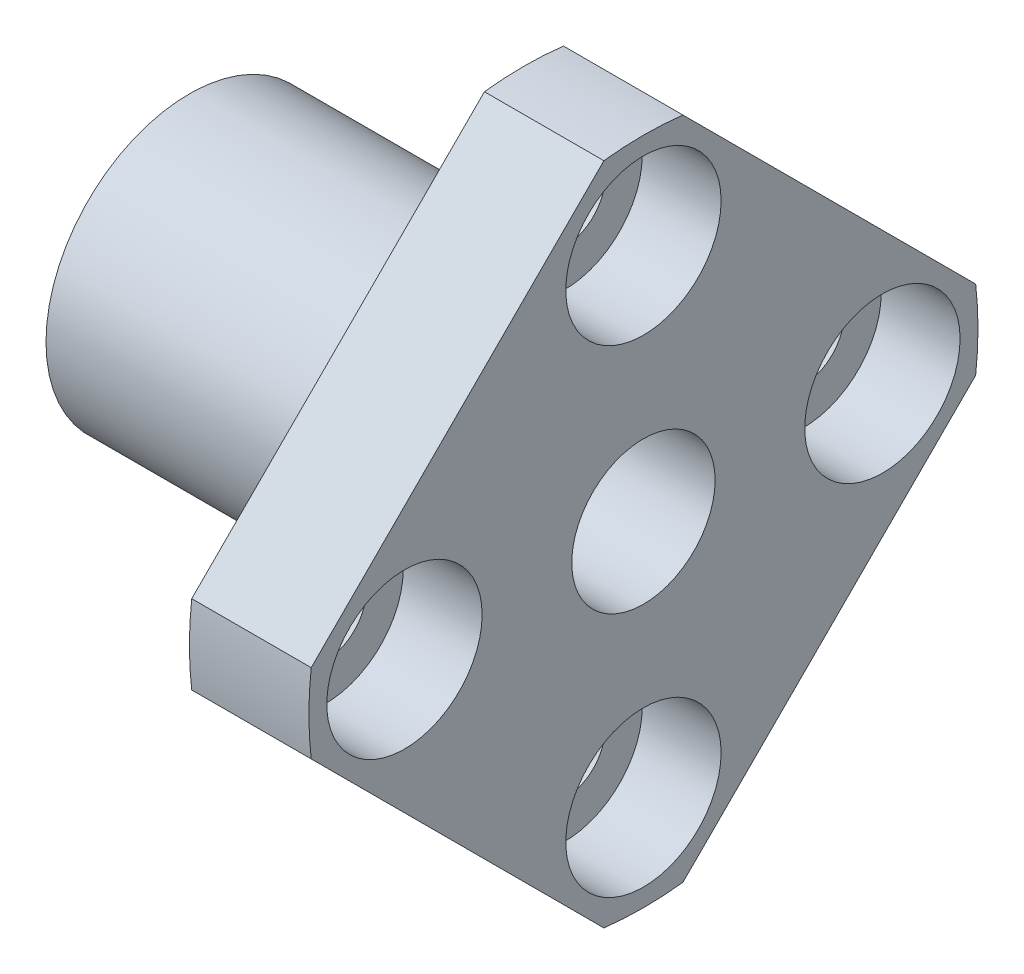
ISO-10303-21;
HEADER;
FILE_DESCRIPTION(('STEP AP214'),'2;1');
FILE_NAME('part.step','',(''),(''),'','','');
FILE_SCHEMA(('AUTOMOTIVE_DESIGN { 1 0 10303 214 1 1 1 1 }'));
ENDSEC;
DATA;
#1=APPLICATION_CONTEXT('core data for automotive mechanical design processes');
#2=APPLICATION_PROTOCOL_DEFINITION('international standard','automotive_design',2000,#1);
#3=PRODUCT_CONTEXT('',#1,'mechanical');
#4=PRODUCT('Part','Part','',(#3));
#5=PRODUCT_RELATED_PRODUCT_CATEGORY('part','',(#4));
#6=PRODUCT_DEFINITION_FORMATION('','',#4);
#7=PRODUCT_DEFINITION_CONTEXT('part definition',#1,'design');
#8=PRODUCT_DEFINITION('design','',#6,#7);
#9=PRODUCT_DEFINITION_SHAPE('','',#8);
#10=(LENGTH_UNIT() NAMED_UNIT(*) SI_UNIT(.MILLI.,.METRE.));
#11=(NAMED_UNIT(*) PLANE_ANGLE_UNIT() SI_UNIT($,.RADIAN.));
#12=(NAMED_UNIT(*) SI_UNIT($,.STERADIAN.) SOLID_ANGLE_UNIT());
#13=UNCERTAINTY_MEASURE_WITH_UNIT(LENGTH_MEASURE(1.E-05),#10,'distance_accuracy_value','');
#14=(GEOMETRIC_REPRESENTATION_CONTEXT(3) GLOBAL_UNCERTAINTY_ASSIGNED_CONTEXT((#13)) GLOBAL_UNIT_ASSIGNED_CONTEXT((#10,
#11,#12)) REPRESENTATION_CONTEXT('',''));
#15=CARTESIAN_POINT('',(0.,0.,0.));
#16=DIRECTION('',(0.,0.,1.));
#17=DIRECTION('',(1.,0.,0.));
#18=AXIS2_PLACEMENT_3D('',#15,#16,#17);
#19=CARTESIAN_POINT('',(19.,0.,0.));
#20=DIRECTION('',(-1.,0.,0.));
#21=DIRECTION('',(0.,0.,1.));
#22=AXIS2_PLACEMENT_3D('',#19,#20,#21);
#23=CYLINDRICAL_SURFACE('',#22,14.);
#24=CARTESIAN_POINT('',(14.,0.,0.));
#25=DIRECTION('',(-1.,0.,0.));
#26=DIRECTION('',(0.,0.,1.));
#27=AXIS2_PLACEMENT_3D('',#24,#25,#26);
#28=CIRCLE('',#27,14.);
#29=CARTESIAN_POINT('',(14.,-1.65445023609401,13.90189895001));
#30=VERTEX_POINT('',#29);
#31=CARTESIAN_POINT('',(14.,1.65445023609401,13.90189895001));
#32=VERTEX_POINT('',#31);
#33=EDGE_CURVE('E132',#30,#32,#28,.T.);
#34=ORIENTED_EDGE('',*,*,#33,.F.);
#35=DIRECTION('',(-1.,0.,0.));
#36=VECTOR('',#35,1.);
#37=CARTESIAN_POINT('',(19.,-1.65445023609401,13.90189895001));
#38=LINE('',#37,#36);
#39=CARTESIAN_POINT('',(19.,-1.65445023609401,13.90189895001));
#40=VERTEX_POINT('',#39);
#41=EDGE_CURVE('E41',#40,#30,#38,.T.);
#42=ORIENTED_EDGE('',*,*,#41,.F.);
#43=CARTESIAN_POINT('',(19.,0.,0.));
#44=DIRECTION('',(-1.,0.,0.));
#45=DIRECTION('',(0.,0.,1.));
#46=AXIS2_PLACEMENT_3D('',#43,#44,#45);
#47=CIRCLE('',#46,14.);
#48=CARTESIAN_POINT('',(19.,1.65445023609401,13.90189895001));
#49=VERTEX_POINT('',#48);
#50=EDGE_CURVE('E154',#40,#49,#47,.T.);
#51=ORIENTED_EDGE('',*,*,#50,.T.);
#52=DIRECTION('',(-1.,0.,0.));
#53=VECTOR('',#52,1.);
#54=CARTESIAN_POINT('',(19.,1.65445023609401,13.90189895001));
#55=LINE('',#54,#53);
#56=EDGE_CURVE('E90',#49,#32,#55,.T.);
#57=ORIENTED_EDGE('',*,*,#56,.T.);
#58=EDGE_LOOP('',(#34,#42,#51,#57));
#59=FACE_BOUND('',#58,.T.);
#60=ADVANCED_FACE('F32',(#59),#23,.T.);
#61=CARTESIAN_POINT('',(19.,-13.90189895001,1.65445023609401));
#62=DIRECTION('',(0.,-0.707106781186548,0.707106781186547));
#63=DIRECTION('',(0.,-0.707106781186547,-0.707106781186548));
#64=AXIS2_PLACEMENT_3D('',#61,#62,#63);
#65=PLANE('',#64);
#66=DIRECTION('',(0.,0.707106781186547,0.707106781186548));
#67=VECTOR('',#66,1.);
#68=CARTESIAN_POINT('',(14.,-13.90189895001,1.65445023609401));
#69=LINE('',#68,#67);
#70=CARTESIAN_POINT('',(14.,-13.90189895001,1.65445023609402));
#71=VERTEX_POINT('',#70);
#72=EDGE_CURVE('E151',#71,#30,#69,.T.);
#73=ORIENTED_EDGE('',*,*,#72,.F.);
#74=DIRECTION('',(-1.,0.,0.));
#75=VECTOR('',#74,1.);
#76=CARTESIAN_POINT('',(19.,-13.90189895001,1.65445023609402));
#77=LINE('',#76,#75);
#78=CARTESIAN_POINT('',(19.,-13.90189895001,1.65445023609402));
#79=VERTEX_POINT('',#78);
#80=EDGE_CURVE('E78',#79,#71,#77,.T.);
#81=ORIENTED_EDGE('',*,*,#80,.F.);
#82=DIRECTION('',(0.,0.707106781186547,0.707106781186548));
#83=VECTOR('',#82,1.);
#84=CARTESIAN_POINT('',(19.,-13.90189895001,1.65445023609401));
#85=LINE('',#84,#83);
#86=EDGE_CURVE('E122',#79,#40,#85,.T.);
#87=ORIENTED_EDGE('',*,*,#86,.T.);
#88=ORIENTED_EDGE('',*,*,#41,.T.);
#89=EDGE_LOOP('',(#73,#81,#87,#88));
#90=FACE_BOUND('',#89,.T.);
#91=ADVANCED_FACE('F229',(#90),#65,.T.);
#92=CARTESIAN_POINT('',(19.,0.,0.));
#93=DIRECTION('',(-1.,0.,0.));
#94=DIRECTION('',(0.,0.,1.));
#95=AXIS2_PLACEMENT_3D('',#92,#93,#94);
#96=CYLINDRICAL_SURFACE('',#95,14.);
#97=CARTESIAN_POINT('',(14.,0.,0.));
#98=DIRECTION('',(-1.,0.,0.));
#99=DIRECTION('',(0.,0.,1.));
#100=AXIS2_PLACEMENT_3D('',#97,#98,#99);
#101=CIRCLE('',#100,14.);
#102=CARTESIAN_POINT('',(14.,-13.90189895001,-1.65445023609401));
#103=VERTEX_POINT('',#102);
#104=EDGE_CURVE('E109',#103,#71,#101,.T.);
#105=ORIENTED_EDGE('',*,*,#104,.F.);
#106=DIRECTION('',(-1.,0.,0.));
#107=VECTOR('',#106,1.);
#108=CARTESIAN_POINT('',(19.,-13.90189895001,-1.65445023609401));
#109=LINE('',#108,#107);
#110=CARTESIAN_POINT('',(19.,-13.90189895001,-1.65445023609401));
#111=VERTEX_POINT('',#110);
#112=EDGE_CURVE('E104',#111,#103,#109,.T.);
#113=ORIENTED_EDGE('',*,*,#112,.F.);
#114=CARTESIAN_POINT('',(19.,0.,0.));
#115=DIRECTION('',(-1.,0.,0.));
#116=DIRECTION('',(0.,0.,1.));
#117=AXIS2_PLACEMENT_3D('',#114,#115,#116);
#118=CIRCLE('',#117,14.);
#119=EDGE_CURVE('E107',#111,#79,#118,.T.);
#120=ORIENTED_EDGE('',*,*,#119,.T.);
#121=ORIENTED_EDGE('',*,*,#80,.T.);
#122=EDGE_LOOP('',(#105,#113,#120,#121));
#123=FACE_BOUND('',#122,.T.);
#124=ADVANCED_FACE('F106',(#123),#96,.T.);
#125=CARTESIAN_POINT('',(19.,-1.65445023609401,-13.90189895001));
#126=DIRECTION('',(0.,-0.707106781186548,-0.707106781186547));
#127=DIRECTION('',(0.,0.707106781186547,-0.707106781186548));
#128=AXIS2_PLACEMENT_3D('',#125,#126,#127);
#129=PLANE('',#128);
#130=DIRECTION('',(0.,-0.707106781186547,0.707106781186548));
#131=VECTOR('',#130,1.);
#132=CARTESIAN_POINT('',(14.,-1.65445023609401,-13.90189895001));
#133=LINE('',#132,#131);
#134=CARTESIAN_POINT('',(14.,-1.65445023609401,-13.90189895001));
#135=VERTEX_POINT('',#134);
#136=EDGE_CURVE('E148',#135,#103,#133,.T.);
#137=ORIENTED_EDGE('',*,*,#136,.F.);
#138=DIRECTION('',(-1.,0.,0.));
#139=VECTOR('',#138,1.);
#140=CARTESIAN_POINT('',(19.,-1.65445023609401,-13.90189895001));
#141=LINE('',#140,#139);
#142=CARTESIAN_POINT('',(19.,-1.65445023609401,-13.90189895001));
#143=VERTEX_POINT('',#142);
#144=EDGE_CURVE('E114',#143,#135,#141,.T.);
#145=ORIENTED_EDGE('',*,*,#144,.F.);
#146=DIRECTION('',(0.,-0.707106781186547,0.707106781186548));
#147=VECTOR('',#146,1.);
#148=CARTESIAN_POINT('',(19.,-1.65445023609401,-13.90189895001));
#149=LINE('',#148,#147);
#150=EDGE_CURVE('E120',#143,#111,#149,.T.);
#151=ORIENTED_EDGE('',*,*,#150,.T.);
#152=ORIENTED_EDGE('',*,*,#112,.T.);
#153=EDGE_LOOP('',(#137,#145,#151,#152));
#154=FACE_BOUND('',#153,.T.);
#155=ADVANCED_FACE('F124',(#154),#129,.T.);
#156=CARTESIAN_POINT('',(19.,0.,0.));
#157=DIRECTION('',(-1.,0.,0.));
#158=DIRECTION('',(0.,0.,1.));
#159=AXIS2_PLACEMENT_3D('',#156,#157,#158);
#160=CYLINDRICAL_SURFACE('',#159,14.);
#161=CARTESIAN_POINT('',(14.,0.,0.));
#162=DIRECTION('',(-1.,0.,0.));
#163=DIRECTION('',(0.,0.,1.));
#164=AXIS2_PLACEMENT_3D('',#161,#162,#163);
#165=CIRCLE('',#164,14.);
#166=CARTESIAN_POINT('',(14.,1.65445023609401,-13.90189895001));
#167=VERTEX_POINT('',#166);
#168=EDGE_CURVE('E145',#167,#135,#165,.T.);
#169=ORIENTED_EDGE('',*,*,#168,.F.);
#170=DIRECTION('',(-1.,0.,0.));
#171=VECTOR('',#170,1.);
#172=CARTESIAN_POINT('',(19.,1.65445023609401,-13.90189895001));
#173=LINE('',#172,#171);
#174=CARTESIAN_POINT('',(19.,1.65445023609401,-13.90189895001));
#175=VERTEX_POINT('',#174);
#176=EDGE_CURVE('E158',#175,#167,#173,.T.);
#177=ORIENTED_EDGE('',*,*,#176,.F.);
#178=CARTESIAN_POINT('',(19.,0.,0.));
#179=DIRECTION('',(-1.,0.,0.));
#180=DIRECTION('',(0.,0.,1.));
#181=AXIS2_PLACEMENT_3D('',#178,#179,#180);
#182=CIRCLE('',#181,14.);
#183=EDGE_CURVE('E125',#175,#143,#182,.T.);
#184=ORIENTED_EDGE('',*,*,#183,.T.);
#185=ORIENTED_EDGE('',*,*,#144,.T.);
#186=EDGE_LOOP('',(#169,#177,#184,#185));
#187=FACE_BOUND('',#186,.T.);
#188=ADVANCED_FACE('F242',(#187),#160,.T.);
#189=CARTESIAN_POINT('',(19.,13.90189895001,-1.65445023609402));
#190=DIRECTION('',(0.,0.707106781186547,-0.707106781186548));
#191=DIRECTION('',(0.,0.707106781186548,0.707106781186547));
#192=AXIS2_PLACEMENT_3D('',#189,#190,#191);
#193=PLANE('',#192);
#194=DIRECTION('',(0.,-0.707106781186548,-0.707106781186548));
#195=VECTOR('',#194,1.);
#196=CARTESIAN_POINT('',(14.,13.90189895001,-1.65445023609402));
#197=LINE('',#196,#195);
#198=CARTESIAN_POINT('',(14.,13.90189895001,-1.65445023609401));
#199=VERTEX_POINT('',#198);
#200=EDGE_CURVE('E142',#199,#167,#197,.T.);
#201=ORIENTED_EDGE('',*,*,#200,.F.);
#202=DIRECTION('',(-1.,0.,0.));
#203=VECTOR('',#202,1.);
#204=CARTESIAN_POINT('',(19.,13.90189895001,-1.65445023609401));
#205=LINE('',#204,#203);
#206=CARTESIAN_POINT('',(19.,13.90189895001,-1.65445023609401));
#207=VERTEX_POINT('',#206);
#208=EDGE_CURVE('E160',#207,#199,#205,.T.);
#209=ORIENTED_EDGE('',*,*,#208,.F.);
#210=DIRECTION('',(0.,-0.707106781186548,-0.707106781186548));
#211=VECTOR('',#210,1.);
#212=CARTESIAN_POINT('',(19.,13.90189895001,-1.65445023609402));
#213=LINE('',#212,#211);
#214=EDGE_CURVE('E127',#207,#175,#213,.T.);
#215=ORIENTED_EDGE('',*,*,#214,.T.);
#216=ORIENTED_EDGE('',*,*,#176,.T.);
#217=EDGE_LOOP('',(#201,#209,#215,#216));
#218=FACE_BOUND('',#217,.T.);
#219=ADVANCED_FACE('F220',(#218),#193,.T.);
#220=CARTESIAN_POINT('',(19.,0.,0.));
#221=DIRECTION('',(-1.,0.,0.));
#222=DIRECTION('',(0.,0.,1.));
#223=AXIS2_PLACEMENT_3D('',#220,#221,#222);
#224=CYLINDRICAL_SURFACE('',#223,14.);
#225=CARTESIAN_POINT('',(14.,0.,0.));
#226=DIRECTION('',(-1.,0.,0.));
#227=DIRECTION('',(0.,0.,1.));
#228=AXIS2_PLACEMENT_3D('',#225,#226,#227);
#229=CIRCLE('',#228,14.);
#230=CARTESIAN_POINT('',(14.,13.90189895001,1.65445023609402));
#231=VERTEX_POINT('',#230);
#232=EDGE_CURVE('E139',#231,#199,#229,.T.);
#233=ORIENTED_EDGE('',*,*,#232,.F.);
#234=DIRECTION('',(-1.,0.,0.));
#235=VECTOR('',#234,1.);
#236=CARTESIAN_POINT('',(19.,13.90189895001,1.65445023609402));
#237=LINE('',#236,#235);
#238=CARTESIAN_POINT('',(19.,13.90189895001,1.65445023609402));
#239=VERTEX_POINT('',#238);
#240=EDGE_CURVE('E162',#239,#231,#237,.T.);
#241=ORIENTED_EDGE('',*,*,#240,.F.);
#242=CARTESIAN_POINT('',(19.,0.,0.));
#243=DIRECTION('',(-1.,0.,0.));
#244=DIRECTION('',(0.,0.,1.));
#245=AXIS2_PLACEMENT_3D('',#242,#243,#244);
#246=CIRCLE('',#245,14.);
#247=EDGE_CURVE('E214',#239,#207,#246,.T.);
#248=ORIENTED_EDGE('',*,*,#247,.T.);
#249=ORIENTED_EDGE('',*,*,#208,.T.);
#250=EDGE_LOOP('',(#233,#241,#248,#249));
#251=FACE_BOUND('',#250,.T.);
#252=ADVANCED_FACE('F225',(#251),#224,.T.);
#253=CARTESIAN_POINT('',(19.,1.65445023609401,13.90189895001));
#254=DIRECTION('',(0.,0.707106781186547,0.707106781186548));
#255=DIRECTION('',(0.,-0.707106781186548,0.707106781186547));
#256=AXIS2_PLACEMENT_3D('',#253,#254,#255);
#257=PLANE('',#256);
#258=DIRECTION('',(0.,0.707106781186548,-0.707106781186547));
#259=VECTOR('',#258,1.);
#260=CARTESIAN_POINT('',(14.,1.65445023609401,13.90189895001));
#261=LINE('',#260,#259);
#262=EDGE_CURVE('E135',#32,#231,#261,.T.);
#263=ORIENTED_EDGE('',*,*,#262,.F.);
#264=ORIENTED_EDGE('',*,*,#56,.F.);
#265=DIRECTION('',(0.,0.707106781186548,-0.707106781186547));
#266=VECTOR('',#265,1.);
#267=CARTESIAN_POINT('',(19.,1.65445023609401,13.90189895001));
#268=LINE('',#267,#266);
#269=EDGE_CURVE('E212',#49,#239,#268,.T.);
#270=ORIENTED_EDGE('',*,*,#269,.T.);
#271=ORIENTED_EDGE('',*,*,#240,.T.);
#272=EDGE_LOOP('',(#263,#264,#270,#271));
#273=FACE_BOUND('',#272,.T.);
#274=ADVANCED_FACE('F226',(#273),#257,.T.);
#275=CARTESIAN_POINT('',(19.,0.,0.));
#276=DIRECTION('',(-1.,0.,0.));
#277=DIRECTION('',(0.,0.,1.));
#278=AXIS2_PLACEMENT_3D('',#275,#276,#277);
#279=PLANE('',#278);
#280=CARTESIAN_POINT('',(19.,-10.,0.));
#281=DIRECTION('',(1.,0.,0.));
#282=DIRECTION('',(0.,0.,-1.));
#283=AXIS2_PLACEMENT_3D('',#280,#281,#282);
#284=CIRCLE('',#283,3.25);
#285=CARTESIAN_POINT('',(19.,-10.,-3.25));
#286=VERTEX_POINT('',#285);
#287=EDGE_CURVE('E326',#286,#286,#284,.T.);
#288=ORIENTED_EDGE('',*,*,#287,.F.);
#289=EDGE_LOOP('',(#288));
#290=FACE_BOUND('',#289,.T.);
#291=CARTESIAN_POINT('',(19.,0.,-10.));
#292=DIRECTION('',(1.,0.,0.));
#293=DIRECTION('',(0.,0.,-1.));
#294=AXIS2_PLACEMENT_3D('',#291,#292,#293);
#295=CIRCLE('',#294,3.25);
#296=CARTESIAN_POINT('',(19.,0.,-13.25));
#297=VERTEX_POINT('',#296);
#298=EDGE_CURVE('E189',#297,#297,#295,.T.);
#299=ORIENTED_EDGE('',*,*,#298,.F.);
#300=EDGE_LOOP('',(#299));
#301=FACE_BOUND('',#300,.T.);
#302=CARTESIAN_POINT('',(19.,0.,10.));
#303=DIRECTION('',(1.,0.,0.));
#304=DIRECTION('',(0.,0.,-1.));
#305=AXIS2_PLACEMENT_3D('',#302,#303,#304);
#306=CIRCLE('',#305,3.25);
#307=CARTESIAN_POINT('',(19.,0.,6.75));
#308=VERTEX_POINT('',#307);
#309=EDGE_CURVE('E176',#308,#308,#306,.T.);
#310=ORIENTED_EDGE('',*,*,#309,.F.);
#311=EDGE_LOOP('',(#310));
#312=FACE_BOUND('',#311,.T.);
#313=CARTESIAN_POINT('',(19.,10.,0.));
#314=DIRECTION('',(1.,0.,0.));
#315=DIRECTION('',(0.,0.,-1.));
#316=AXIS2_PLACEMENT_3D('',#313,#314,#315);
#317=CIRCLE('',#316,3.25);
#318=CARTESIAN_POINT('',(19.,10.,-3.25));
#319=VERTEX_POINT('',#318);
#320=EDGE_CURVE('E172',#319,#319,#317,.T.);
#321=ORIENTED_EDGE('',*,*,#320,.F.);
#322=EDGE_LOOP('',(#321));
#323=FACE_BOUND('',#322,.T.);
#324=CARTESIAN_POINT('',(19.,0.,0.));
#325=DIRECTION('',(1.,0.,0.));
#326=DIRECTION('',(0.,0.,-1.));
#327=AXIS2_PLACEMENT_3D('',#324,#325,#326);
#328=CIRCLE('',#327,2.99999999999999);
#329=CARTESIAN_POINT('',(19.,0.,-2.99999999999999));
#330=VERTEX_POINT('',#329);
#331=EDGE_CURVE('E168',#330,#330,#328,.T.);
#332=ORIENTED_EDGE('',*,*,#331,.F.);
#333=EDGE_LOOP('',(#332));
#334=FACE_BOUND('',#333,.T.);
#335=ORIENTED_EDGE('',*,*,#50,.F.);
#336=ORIENTED_EDGE('',*,*,#86,.F.);
#337=ORIENTED_EDGE('',*,*,#119,.F.);
#338=ORIENTED_EDGE('',*,*,#150,.F.);
#339=ORIENTED_EDGE('',*,*,#183,.F.);
#340=ORIENTED_EDGE('',*,*,#214,.F.);
#341=ORIENTED_EDGE('',*,*,#247,.F.);
#342=ORIENTED_EDGE('',*,*,#269,.F.);
#343=EDGE_LOOP('',(#335,#336,#337,#338,#339,#340,#341,#342));
#344=FACE_BOUND('',#343,.T.);
#345=ADVANCED_FACE('F118',(#290,#301,#312,#323,#334,#344),#279,.F.);
#346=CARTESIAN_POINT('',(14.,0.,0.));
#347=DIRECTION('',(-1.,0.,0.));
#348=DIRECTION('',(0.,0.,1.));
#349=AXIS2_PLACEMENT_3D('',#346,#347,#348);
#350=PLANE('',#349);
#351=CARTESIAN_POINT('',(14.,-10.,0.));
#352=DIRECTION('',(-1.,0.,0.));
#353=DIRECTION('',(0.,0.,1.));
#354=AXIS2_PLACEMENT_3D('',#351,#352,#353);
#355=CIRCLE('',#354,1.70000000000001);
#356=CARTESIAN_POINT('',(14.,-10.,1.70000000000001));
#357=VERTEX_POINT('',#356);
#358=EDGE_CURVE('E35',#357,#357,#355,.T.);
#359=ORIENTED_EDGE('',*,*,#358,.F.);
#360=EDGE_LOOP('',(#359));
#361=FACE_BOUND('',#360,.T.);
#362=CARTESIAN_POINT('',(14.,0.,-10.));
#363=DIRECTION('',(-1.,0.,0.));
#364=DIRECTION('',(0.,0.,1.));
#365=AXIS2_PLACEMENT_3D('',#362,#363,#364);
#366=CIRCLE('',#365,1.70000000000001);
#367=CARTESIAN_POINT('',(14.,0.,-8.29999999999999));
#368=VERTEX_POINT('',#367);
#369=EDGE_CURVE('E174',#368,#368,#366,.T.);
#370=ORIENTED_EDGE('',*,*,#369,.F.);
#371=EDGE_LOOP('',(#370));
#372=FACE_BOUND('',#371,.T.);
#373=CARTESIAN_POINT('',(14.,0.,10.));
#374=DIRECTION('',(-1.,0.,0.));
#375=DIRECTION('',(0.,0.,1.));
#376=AXIS2_PLACEMENT_3D('',#373,#374,#375);
#377=CIRCLE('',#376,1.70000000000001);
#378=CARTESIAN_POINT('',(14.,0.,11.7));
#379=VERTEX_POINT('',#378);
#380=EDGE_CURVE('E170',#379,#379,#377,.T.);
#381=ORIENTED_EDGE('',*,*,#380,.F.);
#382=EDGE_LOOP('',(#381));
#383=FACE_BOUND('',#382,.T.);
#384=CARTESIAN_POINT('',(14.,10.,0.));
#385=DIRECTION('',(-1.,0.,0.));
#386=DIRECTION('',(0.,0.,1.));
#387=AXIS2_PLACEMENT_3D('',#384,#385,#386);
#388=CIRCLE('',#387,1.70000000000001);
#389=CARTESIAN_POINT('',(14.,10.,1.70000000000001));
#390=VERTEX_POINT('',#389);
#391=EDGE_CURVE('E165',#390,#390,#388,.T.);
#392=ORIENTED_EDGE('',*,*,#391,.F.);
#393=EDGE_LOOP('',(#392));
#394=FACE_BOUND('',#393,.T.);
#395=CARTESIAN_POINT('',(14.,0.,0.));
#396=DIRECTION('',(-1.,0.,0.));
#397=DIRECTION('',(0.,0.,1.));
#398=AXIS2_PLACEMENT_3D('',#395,#396,#397);
#399=CIRCLE('',#398,6.);
#400=CARTESIAN_POINT('',(14.,0.,6.));
#401=VERTEX_POINT('',#400);
#402=EDGE_CURVE('E11',#401,#401,#399,.T.);
#403=ORIENTED_EDGE('',*,*,#402,.F.);
#404=EDGE_LOOP('',(#403));
#405=FACE_BOUND('',#404,.T.);
#406=ORIENTED_EDGE('',*,*,#33,.T.);
#407=ORIENTED_EDGE('',*,*,#262,.T.);
#408=ORIENTED_EDGE('',*,*,#232,.T.);
#409=ORIENTED_EDGE('',*,*,#200,.T.);
#410=ORIENTED_EDGE('',*,*,#168,.T.);
#411=ORIENTED_EDGE('',*,*,#136,.T.);
#412=ORIENTED_EDGE('',*,*,#104,.T.);
#413=ORIENTED_EDGE('',*,*,#72,.T.);
#414=EDGE_LOOP('',(#406,#407,#408,#409,#410,#411,#412,#413));
#415=FACE_BOUND('',#414,.T.);
#416=ADVANCED_FACE('F228',(#361,#372,#383,#394,#405,#415),#350,.T.);
#417=CARTESIAN_POINT('',(14.,0.,0.));
#418=DIRECTION('',(-1.,0.,0.));
#419=DIRECTION('',(0.,0.,1.));
#420=AXIS2_PLACEMENT_3D('',#417,#418,#419);
#421=CYLINDRICAL_SURFACE('',#420,6.);
#422=ORIENTED_EDGE('',*,*,#402,.T.);
#423=EDGE_LOOP('',(#422));
#424=FACE_BOUND('',#423,.T.);
#425=CARTESIAN_POINT('',(0.,0.,0.));
#426=DIRECTION('',(-1.,0.,0.));
#427=DIRECTION('',(0.,0.,1.));
#428=AXIS2_PLACEMENT_3D('',#425,#426,#427);
#429=CIRCLE('',#428,6.);
#430=CARTESIAN_POINT('',(0.,0.,6.));
#431=VERTEX_POINT('',#430);
#432=EDGE_CURVE('E136',#431,#431,#429,.T.);
#433=ORIENTED_EDGE('',*,*,#432,.F.);
#434=EDGE_LOOP('',(#433));
#435=FACE_BOUND('',#434,.T.);
#436=ADVANCED_FACE('F257',(#424,#435),#421,.T.);
#437=CARTESIAN_POINT('',(0.,0.,0.));
#438=DIRECTION('',(-1.,0.,0.));
#439=DIRECTION('',(0.,0.,1.));
#440=AXIS2_PLACEMENT_3D('',#437,#438,#439);
#441=PLANE('',#440);
#442=CARTESIAN_POINT('',(0.,0.,0.));
#443=DIRECTION('',(1.,0.,0.));
#444=DIRECTION('',(0.,0.,-1.));
#445=AXIS2_PLACEMENT_3D('',#442,#443,#444);
#446=CIRCLE('',#445,2.99999999999999);
#447=CARTESIAN_POINT('',(0.,0.,-2.99999999999999));
#448=VERTEX_POINT('',#447);
#449=EDGE_CURVE('E206',#448,#448,#446,.T.);
#450=ORIENTED_EDGE('',*,*,#449,.T.);
#451=EDGE_LOOP('',(#450));
#452=FACE_BOUND('',#451,.T.);
#453=ORIENTED_EDGE('',*,*,#432,.T.);
#454=EDGE_LOOP('',(#453));
#455=FACE_BOUND('',#454,.T.);
#456=ADVANCED_FACE('F264',(#452,#455),#441,.T.);
#457=CARTESIAN_POINT('',(19.,0.,0.));
#458=DIRECTION('',(1.,0.,0.));
#459=DIRECTION('',(0.,0.,-1.));
#460=AXIS2_PLACEMENT_3D('',#457,#458,#459);
#461=CYLINDRICAL_SURFACE('',#460,2.99999999999999);
#462=ORIENTED_EDGE('',*,*,#449,.F.);
#463=EDGE_LOOP('',(#462));
#464=FACE_BOUND('',#463,.T.);
#465=ORIENTED_EDGE('',*,*,#331,.T.);
#466=EDGE_LOOP('',(#465));
#467=FACE_BOUND('',#466,.T.);
#468=ADVANCED_FACE('F268',(#464,#467),#461,.F.);
#469=CARTESIAN_POINT('',(19.,10.,0.));
#470=DIRECTION('',(1.,0.,0.));
#471=DIRECTION('',(0.,0.,-1.));
#472=AXIS2_PLACEMENT_3D('',#469,#470,#471);
#473=CYLINDRICAL_SURFACE('',#472,1.70000000000001);
#474=ORIENTED_EDGE('',*,*,#391,.T.);
#475=EDGE_LOOP('',(#474));
#476=FACE_BOUND('',#475,.T.);
#477=CARTESIAN_POINT('',(15.7,10.,0.));
#478=DIRECTION('',(1.,0.,0.));
#479=DIRECTION('',(0.,0.,-1.));
#480=AXIS2_PLACEMENT_3D('',#477,#478,#479);
#481=CIRCLE('',#480,1.70000000000001);
#482=CARTESIAN_POINT('',(15.7,10.,-1.70000000000001));
#483=VERTEX_POINT('',#482);
#484=EDGE_CURVE('E169',#483,#483,#481,.T.);
#485=ORIENTED_EDGE('',*,*,#484,.T.);
#486=EDGE_LOOP('',(#485));
#487=FACE_BOUND('',#486,.T.);
#488=ADVANCED_FACE('F272',(#476,#487),#473,.F.);
#489=CARTESIAN_POINT('',(15.7,11.7,0.));
#490=DIRECTION('',(-1.,0.,0.));
#491=DIRECTION('',(0.,0.,1.));
#492=AXIS2_PLACEMENT_3D('',#489,#490,#491);
#493=PLANE('',#492);
#494=ORIENTED_EDGE('',*,*,#484,.F.);
#495=EDGE_LOOP('',(#494));
#496=FACE_BOUND('',#495,.T.);
#497=CARTESIAN_POINT('',(15.7,10.,0.));
#498=DIRECTION('',(1.,0.,0.));
#499=DIRECTION('',(0.,0.,-1.));
#500=AXIS2_PLACEMENT_3D('',#497,#498,#499);
#501=CIRCLE('',#500,3.25);
#502=CARTESIAN_POINT('',(15.7,10.,-3.25));
#503=VERTEX_POINT('',#502);
#504=EDGE_CURVE('E199',#503,#503,#501,.T.);
#505=ORIENTED_EDGE('',*,*,#504,.T.);
#506=EDGE_LOOP('',(#505));
#507=FACE_BOUND('',#506,.T.);
#508=ADVANCED_FACE('F276',(#496,#507),#493,.F.);
#509=CARTESIAN_POINT('',(19.,10.,0.));
#510=DIRECTION('',(1.,0.,0.));
#511=DIRECTION('',(0.,0.,-1.));
#512=AXIS2_PLACEMENT_3D('',#509,#510,#511);
#513=CYLINDRICAL_SURFACE('',#512,3.25);
#514=ORIENTED_EDGE('',*,*,#504,.F.);
#515=EDGE_LOOP('',(#514));
#516=FACE_BOUND('',#515,.T.);
#517=ORIENTED_EDGE('',*,*,#320,.T.);
#518=EDGE_LOOP('',(#517));
#519=FACE_BOUND('',#518,.T.);
#520=ADVANCED_FACE('F280',(#516,#519),#513,.F.);
#521=CARTESIAN_POINT('',(19.,0.,10.));
#522=DIRECTION('',(1.,0.,0.));
#523=DIRECTION('',(0.,0.,-1.));
#524=AXIS2_PLACEMENT_3D('',#521,#522,#523);
#525=CYLINDRICAL_SURFACE('',#524,1.70000000000001);
#526=ORIENTED_EDGE('',*,*,#380,.T.);
#527=EDGE_LOOP('',(#526));
#528=FACE_BOUND('',#527,.T.);
#529=CARTESIAN_POINT('',(15.7,0.,10.));
#530=DIRECTION('',(1.,0.,0.));
#531=DIRECTION('',(0.,0.,-1.));
#532=AXIS2_PLACEMENT_3D('',#529,#530,#531);
#533=CIRCLE('',#532,1.70000000000001);
#534=CARTESIAN_POINT('',(15.7,0.,8.29999999999999));
#535=VERTEX_POINT('',#534);
#536=EDGE_CURVE('E173',#535,#535,#533,.T.);
#537=ORIENTED_EDGE('',*,*,#536,.T.);
#538=EDGE_LOOP('',(#537));
#539=FACE_BOUND('',#538,.T.);
#540=ADVANCED_FACE('F284',(#528,#539),#525,.F.);
#541=CARTESIAN_POINT('',(15.7,1.70000000000001,10.));
#542=DIRECTION('',(-1.,0.,0.));
#543=DIRECTION('',(0.,0.,1.));
#544=AXIS2_PLACEMENT_3D('',#541,#542,#543);
#545=PLANE('',#544);
#546=ORIENTED_EDGE('',*,*,#536,.F.);
#547=EDGE_LOOP('',(#546));
#548=FACE_BOUND('',#547,.T.);
#549=CARTESIAN_POINT('',(15.7,0.,10.));
#550=DIRECTION('',(1.,0.,0.));
#551=DIRECTION('',(0.,0.,-1.));
#552=AXIS2_PLACEMENT_3D('',#549,#550,#551);
#553=CIRCLE('',#552,3.25);
#554=CARTESIAN_POINT('',(15.7,0.,6.75));
#555=VERTEX_POINT('',#554);
#556=EDGE_CURVE('E181',#555,#555,#553,.T.);
#557=ORIENTED_EDGE('',*,*,#556,.T.);
#558=EDGE_LOOP('',(#557));
#559=FACE_BOUND('',#558,.T.);
#560=ADVANCED_FACE('F288',(#548,#559),#545,.F.);
#561=CARTESIAN_POINT('',(19.,0.,10.));
#562=DIRECTION('',(1.,0.,0.));
#563=DIRECTION('',(0.,0.,-1.));
#564=AXIS2_PLACEMENT_3D('',#561,#562,#563);
#565=CYLINDRICAL_SURFACE('',#564,3.25);
#566=ORIENTED_EDGE('',*,*,#556,.F.);
#567=EDGE_LOOP('',(#566));
#568=FACE_BOUND('',#567,.T.);
#569=ORIENTED_EDGE('',*,*,#309,.T.);
#570=EDGE_LOOP('',(#569));
#571=FACE_BOUND('',#570,.T.);
#572=ADVANCED_FACE('F292',(#568,#571),#565,.F.);
#573=CARTESIAN_POINT('',(19.,0.,-10.));
#574=DIRECTION('',(1.,0.,0.));
#575=DIRECTION('',(0.,0.,-1.));
#576=AXIS2_PLACEMENT_3D('',#573,#574,#575);
#577=CYLINDRICAL_SURFACE('',#576,1.70000000000001);
#578=ORIENTED_EDGE('',*,*,#369,.T.);
#579=EDGE_LOOP('',(#578));
#580=FACE_BOUND('',#579,.T.);
#581=CARTESIAN_POINT('',(15.7,0.,-10.));
#582=DIRECTION('',(1.,0.,0.));
#583=DIRECTION('',(0.,0.,-1.));
#584=AXIS2_PLACEMENT_3D('',#581,#582,#583);
#585=CIRCLE('',#584,1.70000000000001);
#586=CARTESIAN_POINT('',(15.7,0.,-11.7));
#587=VERTEX_POINT('',#586);
#588=EDGE_CURVE('E177',#587,#587,#585,.T.);
#589=ORIENTED_EDGE('',*,*,#588,.T.);
#590=EDGE_LOOP('',(#589));
#591=FACE_BOUND('',#590,.T.);
#592=ADVANCED_FACE('F296',(#580,#591),#577,.F.);
#593=CARTESIAN_POINT('',(15.7,1.70000000000001,-10.));
#594=DIRECTION('',(-1.,0.,0.));
#595=DIRECTION('',(0.,0.,1.));
#596=AXIS2_PLACEMENT_3D('',#593,#594,#595);
#597=PLANE('',#596);
#598=ORIENTED_EDGE('',*,*,#588,.F.);
#599=EDGE_LOOP('',(#598));
#600=FACE_BOUND('',#599,.T.);
#601=CARTESIAN_POINT('',(15.7,0.,-10.));
#602=DIRECTION('',(1.,0.,0.));
#603=DIRECTION('',(0.,0.,-1.));
#604=AXIS2_PLACEMENT_3D('',#601,#602,#603);
#605=CIRCLE('',#604,3.25);
#606=CARTESIAN_POINT('',(15.7,0.,-13.25));
#607=VERTEX_POINT('',#606);
#608=EDGE_CURVE('E184',#607,#607,#605,.T.);
#609=ORIENTED_EDGE('',*,*,#608,.T.);
#610=EDGE_LOOP('',(#609));
#611=FACE_BOUND('',#610,.T.);
#612=ADVANCED_FACE('F300',(#600,#611),#597,.F.);
#613=CARTESIAN_POINT('',(19.,0.,-10.));
#614=DIRECTION('',(1.,0.,0.));
#615=DIRECTION('',(0.,0.,-1.));
#616=AXIS2_PLACEMENT_3D('',#613,#614,#615);
#617=CYLINDRICAL_SURFACE('',#616,3.25);
#618=ORIENTED_EDGE('',*,*,#608,.F.);
#619=EDGE_LOOP('',(#618));
#620=FACE_BOUND('',#619,.T.);
#621=ORIENTED_EDGE('',*,*,#298,.T.);
#622=EDGE_LOOP('',(#621));
#623=FACE_BOUND('',#622,.T.);
#624=ADVANCED_FACE('F303',(#620,#623),#617,.F.);
#625=CARTESIAN_POINT('',(19.,-10.,0.));
#626=DIRECTION('',(1.,0.,0.));
#627=DIRECTION('',(0.,0.,-1.));
#628=AXIS2_PLACEMENT_3D('',#625,#626,#627);
#629=CYLINDRICAL_SURFACE('',#628,1.70000000000001);
#630=ORIENTED_EDGE('',*,*,#358,.T.);
#631=EDGE_LOOP('',(#630));
#632=FACE_BOUND('',#631,.T.);
#633=CARTESIAN_POINT('',(15.7,-10.,0.));
#634=DIRECTION('',(1.,0.,0.));
#635=DIRECTION('',(0.,0.,-1.));
#636=AXIS2_PLACEMENT_3D('',#633,#634,#635);
#637=CIRCLE('',#636,1.70000000000001);
#638=CARTESIAN_POINT('',(15.7,-10.,-1.70000000000001));
#639=VERTEX_POINT('',#638);
#640=EDGE_CURVE('E328',#639,#639,#637,.T.);
#641=ORIENTED_EDGE('',*,*,#640,.T.);
#642=EDGE_LOOP('',(#641));
#643=FACE_BOUND('',#642,.T.);
#644=ADVANCED_FACE('F307',(#632,#643),#629,.F.);
#645=CARTESIAN_POINT('',(15.7,-8.29999999999999,0.));
#646=DIRECTION('',(-1.,0.,0.));
#647=DIRECTION('',(0.,0.,1.));
#648=AXIS2_PLACEMENT_3D('',#645,#646,#647);
#649=PLANE('',#648);
#650=ORIENTED_EDGE('',*,*,#640,.F.);
#651=EDGE_LOOP('',(#650));
#652=FACE_BOUND('',#651,.T.);
#653=CARTESIAN_POINT('',(15.7,-10.,0.));
#654=DIRECTION('',(1.,0.,0.));
#655=DIRECTION('',(0.,0.,-1.));
#656=AXIS2_PLACEMENT_3D('',#653,#654,#655);
#657=CIRCLE('',#656,3.25);
#658=CARTESIAN_POINT('',(15.7,-10.,-3.25));
#659=VERTEX_POINT('',#658);
#660=EDGE_CURVE('E324',#659,#659,#657,.T.);
#661=ORIENTED_EDGE('',*,*,#660,.T.);
#662=EDGE_LOOP('',(#661));
#663=FACE_BOUND('',#662,.T.);
#664=ADVANCED_FACE('F311',(#652,#663),#649,.F.);
#665=CARTESIAN_POINT('',(19.,-10.,0.));
#666=DIRECTION('',(1.,0.,0.));
#667=DIRECTION('',(0.,0.,-1.));
#668=AXIS2_PLACEMENT_3D('',#665,#666,#667);
#669=CYLINDRICAL_SURFACE('',#668,3.25);
#670=ORIENTED_EDGE('',*,*,#660,.F.);
#671=EDGE_LOOP('',(#670));
#672=FACE_BOUND('',#671,.T.);
#673=ORIENTED_EDGE('',*,*,#287,.T.);
#674=EDGE_LOOP('',(#673));
#675=FACE_BOUND('',#674,.T.);
#676=ADVANCED_FACE('F315',(#672,#675),#669,.F.);
#677=CLOSED_SHELL('',(#60,#91,#124,#155,#188,#219,#252,#274,#345,#416,#436,#456,#468,#488,#508,
#520,#540,#560,#572,#592,#612,#624,#644,#664,#676));
#678=MANIFOLD_SOLID_BREP('B2',#677);
#679=ADVANCED_BREP_SHAPE_REPRESENTATION('',(#18,#678),#14);
#680=SHAPE_DEFINITION_REPRESENTATION(#9,#679);
ENDSEC;
END-ISO-10303-21;
